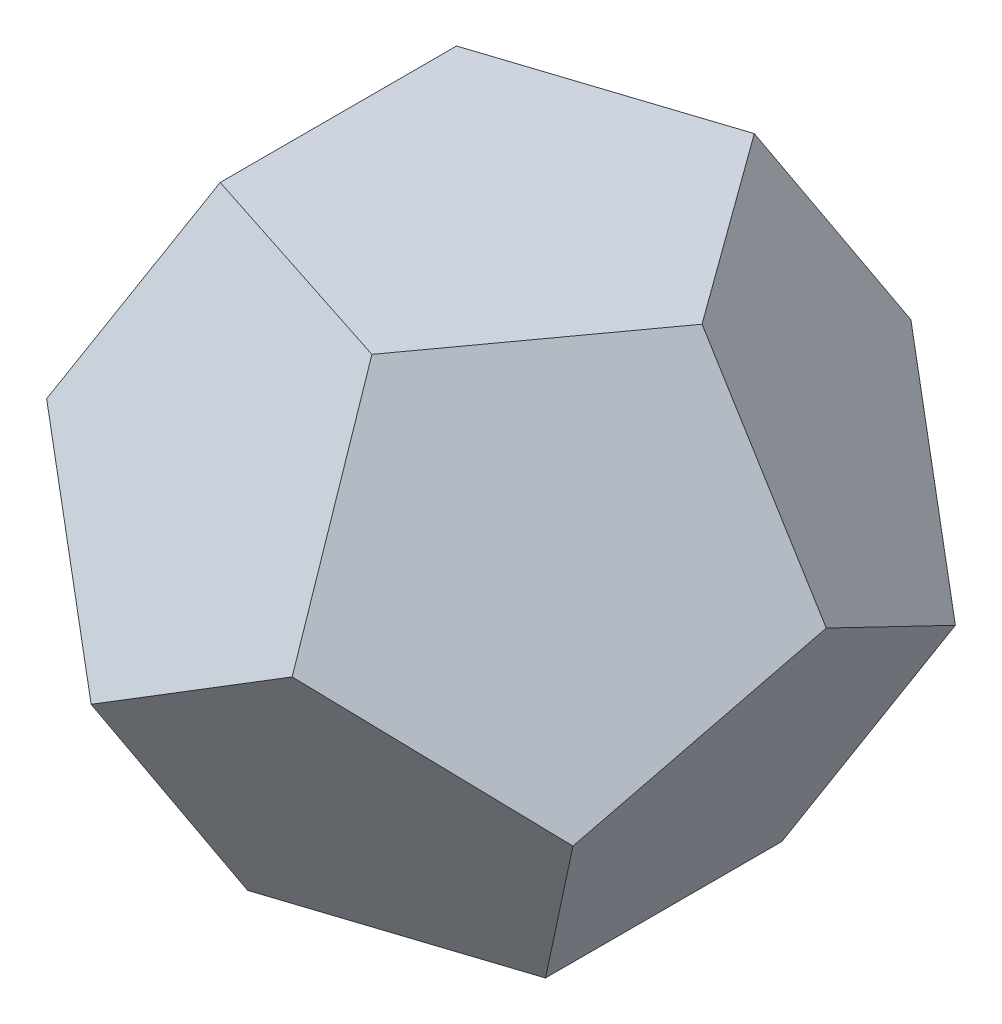
ISO-10303-21;
HEADER;
FILE_DESCRIPTION(('STEP AP214'),'2;1');
FILE_NAME('part.step','',(''),(''),'','','');
FILE_SCHEMA(('AUTOMOTIVE_DESIGN { 1 0 10303 214 1 1 1 1 }'));
ENDSEC;
DATA;
#1=APPLICATION_CONTEXT('core data for automotive mechanical design processes');
#2=APPLICATION_PROTOCOL_DEFINITION('international standard','automotive_design',2000,#1);
#3=PRODUCT_CONTEXT('',#1,'mechanical');
#4=PRODUCT('Part','Part','',(#3));
#5=PRODUCT_RELATED_PRODUCT_CATEGORY('part','',(#4));
#6=PRODUCT_DEFINITION_FORMATION('','',#4);
#7=PRODUCT_DEFINITION_CONTEXT('part definition',#1,'design');
#8=PRODUCT_DEFINITION('design','',#6,#7);
#9=PRODUCT_DEFINITION_SHAPE('','',#8);
#10=(LENGTH_UNIT() NAMED_UNIT(*) SI_UNIT(.MILLI.,.METRE.));
#11=(NAMED_UNIT(*) PLANE_ANGLE_UNIT() SI_UNIT($,.RADIAN.));
#12=(NAMED_UNIT(*) SI_UNIT($,.STERADIAN.) SOLID_ANGLE_UNIT());
#13=UNCERTAINTY_MEASURE_WITH_UNIT(LENGTH_MEASURE(1.E-05),#10,'distance_accuracy_value','');
#14=(GEOMETRIC_REPRESENTATION_CONTEXT(3) GLOBAL_UNCERTAINTY_ASSIGNED_CONTEXT((#13)) GLOBAL_UNIT_ASSIGNED_CONTEXT((#10,
#11,#12)) REPRESENTATION_CONTEXT('',''));
#15=CARTESIAN_POINT('',(0.,0.,0.));
#16=DIRECTION('',(0.,0.,1.));
#17=DIRECTION('',(1.,0.,0.));
#18=AXIS2_PLACEMENT_3D('',#15,#16,#17);
#19=CARTESIAN_POINT('',(-16.5993218992186,-70.3158559454907,-51.0874597374976));
#20=DIRECTION('',(0.187592474085081,0.794654472291766,0.577350269189626));
#21=DIRECTION('',(0.,-0.587785252292473,0.809016994374948));
#22=AXIS2_PLACEMENT_3D('',#19,#20,#21);
#23=PLANE('',#22);
#24=DIRECTION('',(-0.951056516295153,0.,0.309016994374949));
#25=VECTOR('',#24,1.);
#26=CARTESIAN_POINT('',(15.3884176858763,-80.5748010694083,-47.360679774998));
#27=LINE('',#26,#25);
#28=CARTESIAN_POINT('',(15.3884176858763,-80.5748010694083,-47.360679774998));
#29=VERTEX_POINT('',#28);
#30=CARTESIAN_POINT('',(-40.2874005347042,-80.5748010694083,-29.2705098312484));
#31=VERTEX_POINT('',#30);
#32=EDGE_CURVE('E53',#29,#31,#27,.T.);
#33=ORIENTED_EDGE('',*,*,#32,.F.);
#34=DIRECTION('',(0.262865556059569,0.525731112119133,-0.809016994374947));
#35=VECTOR('',#34,1.);
#36=CARTESIAN_POINT('',(-1.11022302462516E-13,-111.351636441161,0.));
#37=LINE('',#36,#35);
#38=CARTESIAN_POINT('',(-1.29236898960272E-13,-111.351636441161,0.));
#39=VERTEX_POINT('',#38);
#40=EDGE_CURVE('E106',#39,#29,#37,.T.);
#41=ORIENTED_EDGE('',*,*,#40,.F.);
#42=DIRECTION('',(-0.688190960235587,0.525731112119134,-0.499999999999999));
#43=VECTOR('',#42,1.);
#44=CARTESIAN_POINT('',(-40.2874005347042,-80.5748010694083,-29.2705098312484));
#45=LINE('',#44,#43);
#46=EDGE_CURVE('E101',#39,#31,#45,.T.);
#47=ORIENTED_EDGE('',*,*,#46,.T.);
#48=EDGE_LOOP('',(#33,#41,#47));
#49=FACE_BOUND('',#48,.T.);
#50=ADVANCED_FACE('F50',(#49),#23,.F.);
#51=CARTESIAN_POINT('',(-16.5993218992187,-10.2589451239176,-51.0874597374977));
#52=DIRECTION('',(-0.303530999103345,-0.187592474085081,-0.934172358962715));
#53=DIRECTION('',(-0.951056516295153,0.,0.309016994374949));
#54=AXIS2_PLACEMENT_3D('',#51,#52,#53);
#55=PLANE('',#54);
#56=DIRECTION('',(0.525731112119134,-0.850650808352039,0.));
#57=VECTOR('',#56,1.);
#58=CARTESIAN_POINT('',(-15.3884176858764,-30.7768353717526,-47.360679774998));
#59=LINE('',#58,#57);
#60=CARTESIAN_POINT('',(-15.3884176858764,-30.7768353717526,-47.360679774998));
#61=VERTEX_POINT('',#60);
#62=EDGE_CURVE('E111',#61,#29,#59,.T.);
#63=ORIENTED_EDGE('',*,*,#62,.T.);
#64=ORIENTED_EDGE('',*,*,#32,.T.);
#65=DIRECTION('',(0.425325404176019,0.85065080835204,-0.309016994374949));
#66=VECTOR('',#65,1.);
#67=CARTESIAN_POINT('',(-40.2874005347042,-80.5748010694083,-29.2705098312484));
#68=LINE('',#67,#66);
#69=EDGE_CURVE('E114',#31,#61,#68,.T.);
#70=ORIENTED_EDGE('',*,*,#69,.T.);
#71=EDGE_LOOP('',(#63,#64,#70));
#72=FACE_BOUND('',#71,.T.);
#73=ADVANCED_FACE('F113',(#72),#55,.T.);
#74=CARTESIAN_POINT('',(-53.7165340462723,-70.3158559454908,0.));
#75=DIRECTION('',(0.607061998206687,0.794654472291766,0.));
#76=DIRECTION('',(-0.794654472291766,0.607061998206686,0.));
#77=AXIS2_PLACEMENT_3D('',#74,#75,#76);
#78=PLANE('',#77);
#79=DIRECTION('',(0.,0.,1.));
#80=VECTOR('',#79,1.);
#81=CARTESIAN_POINT('',(-40.2874005347042,-80.5748010694083,-29.2705098312484));
#82=LINE('',#81,#80);
#83=CARTESIAN_POINT('',(-40.2874005347043,-80.5748010694083,29.2705098312485));
#84=VERTEX_POINT('',#83);
#85=EDGE_CURVE('E142',#31,#84,#82,.T.);
#86=ORIENTED_EDGE('',*,*,#85,.F.);
#87=ORIENTED_EDGE('',*,*,#46,.F.);
#88=DIRECTION('',(-0.688190960235586,0.525731112119133,0.500000000000001));
#89=VECTOR('',#88,1.);
#90=CARTESIAN_POINT('',(-40.2874005347043,-80.5748010694082,29.2705098312485));
#91=LINE('',#90,#89);
#92=EDGE_CURVE('E168',#39,#84,#91,.T.);
#93=ORIENTED_EDGE('',*,*,#92,.T.);
#94=EDGE_LOOP('',(#86,#87,#93));
#95=FACE_BOUND('',#94,.T.);
#96=ADVANCED_FACE('F447',(#95),#78,.F.);
#97=CARTESIAN_POINT('',(43.4575889223547,-70.3158559454908,-31.5737865166652));
#98=DIRECTION('',(0.491123473188423,-0.794654472291767,-0.356822089773089));
#99=DIRECTION('',(0.85065080835204,0.525731112119134,0.));
#100=AXIS2_PLACEMENT_3D('',#97,#98,#99);
#101=PLANE('',#100);
#102=DIRECTION('',(-0.85065080835204,-0.525731112119134,0.));
#103=VECTOR('',#102,1.);
#104=CARTESIAN_POINT('',(49.7979656976556,-80.5748010694082,0.));
#105=LINE('',#104,#103);
#106=CARTESIAN_POINT('',(49.7979656976556,-80.5748010694083,0.));
#107=VERTEX_POINT('',#106);
#108=EDGE_CURVE('E135',#107,#39,#105,.T.);
#109=ORIENTED_EDGE('',*,*,#108,.T.);
#110=ORIENTED_EDGE('',*,*,#40,.T.);
#111=DIRECTION('',(-0.587785252292473,0.,-0.809016994374948));
#112=VECTOR('',#111,1.);
#113=CARTESIAN_POINT('',(15.3884176858763,-80.5748010694083,-47.360679774998));
#114=LINE('',#113,#112);
#115=EDGE_CURVE('E129',#107,#29,#114,.T.);
#116=ORIENTED_EDGE('',*,*,#115,.F.);
#117=EDGE_LOOP('',(#109,#110,#116));
#118=FACE_BOUND('',#117,.T.);
#119=ADVANCED_FACE('F133',(#118),#101,.T.);
#120=CARTESIAN_POINT('',(10.2589451239175,6.34037677530105,-31.5737865166654));
#121=DIRECTION('',(-0.303530999103342,-0.18759247408508,0.934172358962716));
#122=DIRECTION('',(0.951056516295154,0.,0.309016994374947));
#123=AXIS2_PLACEMENT_3D('',#120,#121,#122);
#124=PLANE('',#123);
#125=DIRECTION('',(-0.951056516295154,0.,-0.309016994374947));
#126=VECTOR('',#125,1.);
#127=CARTESIAN_POINT('',(-15.3884176858764,-30.7768353717526,-47.360679774998));
#128=LINE('',#127,#126);
#129=CARTESIAN_POINT('',(40.2874005347042,-30.7768353717526,-29.2705098312485));
#130=VERTEX_POINT('',#129);
#131=EDGE_CURVE('E123',#130,#61,#128,.T.);
#132=ORIENTED_EDGE('',*,*,#131,.F.);
#133=DIRECTION('',(0.42532540417602,0.85065080835204,0.309016994374947));
#134=VECTOR('',#133,1.);
#135=CARTESIAN_POINT('',(15.3884176858763,-80.5748010694083,-47.360679774998));
#136=LINE('',#135,#134);
#137=EDGE_CURVE('E118',#29,#130,#136,.T.);
#138=ORIENTED_EDGE('',*,*,#137,.F.);
#139=ORIENTED_EDGE('',*,*,#62,.F.);
#140=EDGE_LOOP('',(#132,#138,#139));
#141=FACE_BOUND('',#140,.T.);
#142=ADVANCED_FACE('F121',(#141),#124,.F.);
#143=CARTESIAN_POINT('',(43.4575889223547,-10.2589451239176,-31.5737865166653));
#144=DIRECTION('',(-0.794654472291766,0.187592474085081,0.577350269189625));
#145=DIRECTION('',(0.587785252292473,0.,0.809016994374948));
#146=AXIS2_PLACEMENT_3D('',#143,#144,#145);
#147=PLANE('',#146);
#148=ORIENTED_EDGE('',*,*,#137,.T.);
#149=DIRECTION('',(0.162459848116452,-0.85065080835204,0.5));
#150=VECTOR('',#149,1.);
#151=CARTESIAN_POINT('',(49.7979656976557,-80.5748010694083,0.));
#152=LINE('',#151,#150);
#153=EDGE_CURVE('E140',#130,#107,#152,.T.);
#154=ORIENTED_EDGE('',*,*,#153,.T.);
#155=ORIENTED_EDGE('',*,*,#115,.T.);
#156=EDGE_LOOP('',(#148,#154,#155));
#157=FACE_BOUND('',#156,.T.);
#158=ADVANCED_FACE('F139',(#157),#147,.F.);
#159=CARTESIAN_POINT('',(-53.7165340462722,-10.2589451239175,-1.15180933535482E-13));
#160=DIRECTION('',(-0.982246946376846,-0.187592474085079,0.));
#161=DIRECTION('',(0.187592474085079,-0.982246946376846,0.));
#162=AXIS2_PLACEMENT_3D('',#159,#160,#161);
#163=PLANE('',#162);
#164=DIRECTION('',(0.162459848116453,-0.85065080835204,-0.499999999999999));
#165=VECTOR('',#164,1.);
#166=CARTESIAN_POINT('',(-49.7979656976558,-30.7768353717526,0.));
#167=LINE('',#166,#165);
#168=CARTESIAN_POINT('',(-49.7979656976558,-30.7768353717526,0.));
#169=VERTEX_POINT('',#168);
#170=EDGE_CURVE('E149',#169,#31,#167,.T.);
#171=ORIENTED_EDGE('',*,*,#170,.T.);
#172=ORIENTED_EDGE('',*,*,#85,.T.);
#173=DIRECTION('',(0.162459848116451,-0.85065080835204,0.5));
#174=VECTOR('',#173,1.);
#175=CARTESIAN_POINT('',(-49.7979656976558,-30.7768353717526,0.));
#176=LINE('',#175,#174);
#177=EDGE_CURVE('E198',#169,#84,#176,.T.);
#178=ORIENTED_EDGE('',*,*,#177,.F.);
#179=EDGE_LOOP('',(#171,#172,#178));
#180=FACE_BOUND('',#179,.T.);
#181=ADVANCED_FACE('F424',(#180),#163,.T.);
#182=CARTESIAN_POINT('',(-26.8582670231362,6.34037677530102,-19.5136732208324));
#183=DIRECTION('',(0.794654472291767,-0.187592474085079,0.577350269189626));
#184=DIRECTION('',(0.587785252292473,0.,-0.809016994374948));
#185=AXIS2_PLACEMENT_3D('',#182,#183,#184);
#186=PLANE('',#185);
#187=DIRECTION('',(-0.587785252292473,0.,0.809016994374948));
#188=VECTOR('',#187,1.);
#189=CARTESIAN_POINT('',(-49.7979656976558,-30.7768353717526,0.));
#190=LINE('',#189,#188);
#191=EDGE_CURVE('E194',#61,#169,#190,.T.);
#192=ORIENTED_EDGE('',*,*,#191,.F.);
#193=ORIENTED_EDGE('',*,*,#69,.F.);
#194=ORIENTED_EDGE('',*,*,#170,.F.);
#195=EDGE_LOOP('',(#192,#193,#194));
#196=FACE_BOUND('',#195,.T.);
#197=ADVANCED_FACE('F422',(#196),#186,.F.);
#198=CARTESIAN_POINT('',(-16.5993218992185,-70.3158559454908,51.0874597374976));
#199=DIRECTION('',(0.187592474085079,0.794654472291766,-0.577350269189626));
#200=DIRECTION('',(0.,0.587785252292473,0.809016994374947));
#201=AXIS2_PLACEMENT_3D('',#198,#199,#200);
#202=PLANE('',#201);
#203=DIRECTION('',(-0.951056516295154,0.,-0.309016994374947));
#204=VECTOR('',#203,1.);
#205=CARTESIAN_POINT('',(-40.2874005347043,-80.5748010694083,29.2705098312485));
#206=LINE('',#205,#204);
#207=CARTESIAN_POINT('',(15.3884176858762,-80.5748010694083,47.360679774998));
#208=VERTEX_POINT('',#207);
#209=EDGE_CURVE('E270',#208,#84,#206,.T.);
#210=ORIENTED_EDGE('',*,*,#209,.T.);
#211=ORIENTED_EDGE('',*,*,#92,.F.);
#212=DIRECTION('',(0.262865556059567,0.525731112119133,0.809016994374947));
#213=VECTOR('',#212,1.);
#214=CARTESIAN_POINT('',(15.3884176858762,-80.5748010694083,47.360679774998));
#215=LINE('',#214,#213);
#216=EDGE_CURVE('E242',#39,#208,#215,.T.);
#217=ORIENTED_EDGE('',*,*,#216,.T.);
#218=EDGE_LOOP('',(#210,#211,#217));
#219=FACE_BOUND('',#218,.T.);
#220=ADVANCED_FACE('F428',(#219),#202,.F.);
#221=CARTESIAN_POINT('',(43.4575889223547,-70.3158559454907,31.5737865166653));
#222=DIRECTION('',(-0.491123473188423,0.794654472291766,-0.356822089773089));
#223=DIRECTION('',(-0.85065080835204,-0.525731112119134,0.));
#224=AXIS2_PLACEMENT_3D('',#221,#222,#223);
#225=PLANE('',#224);
#226=ORIENTED_EDGE('',*,*,#216,.F.);
#227=ORIENTED_EDGE('',*,*,#108,.F.);
#228=DIRECTION('',(-0.587785252292473,0.,0.809016994374948));
#229=VECTOR('',#228,1.);
#230=CARTESIAN_POINT('',(15.3884176858762,-80.5748010694083,47.360679774998));
#231=LINE('',#230,#229);
#232=EDGE_CURVE('E254',#107,#208,#231,.T.);
#233=ORIENTED_EDGE('',*,*,#232,.T.);
#234=EDGE_LOOP('',(#226,#227,#233));
#235=FACE_BOUND('',#234,.T.);
#236=ADVANCED_FACE('F397',(#235),#225,.F.);
#237=CARTESIAN_POINT('',(0.,0.,0.));
#238=DIRECTION('',(-0.187592474085079,-0.794654472291767,0.577350269189625));
#239=DIRECTION('',(0.,-0.587785252292473,-0.809016994374948));
#240=AXIS2_PLACEMENT_3D('',#237,#238,#239);
#241=PLANE('',#240);
#242=ORIENTED_EDGE('',*,*,#131,.T.);
#243=DIRECTION('',(-0.262865556059568,-0.525731112119133,-0.809016994374947));
#244=VECTOR('',#243,1.);
#245=CARTESIAN_POINT('',(-15.3884176858764,-30.7768353717526,-47.360679774998));
#246=LINE('',#245,#244);
#247=CARTESIAN_POINT('',(0.,0.,0.));
#248=VERTEX_POINT('',#247);
#249=EDGE_CURVE('E282',#248,#61,#246,.T.);
#250=ORIENTED_EDGE('',*,*,#249,.F.);
#251=DIRECTION('',(-0.688190960235587,0.525731112119133,0.5));
#252=VECTOR('',#251,1.);
#253=CARTESIAN_POINT('',(40.2874005347042,-30.7768353717526,-29.2705098312485));
#254=LINE('',#253,#252);
#255=EDGE_CURVE('E335',#130,#248,#254,.T.);
#256=ORIENTED_EDGE('',*,*,#255,.F.);
#257=EDGE_LOOP('',(#242,#250,#256));
#258=FACE_BOUND('',#257,.T.);
#259=ADVANCED_FACE('F386',(#258),#241,.F.);
#260=CARTESIAN_POINT('',(33.1986437984372,6.340376775301,0.));
#261=DIRECTION('',(-0.982246946376846,-0.187592474085079,0.));
#262=DIRECTION('',(0.187592474085079,-0.982246946376846,0.));
#263=AXIS2_PLACEMENT_3D('',#260,#261,#262);
#264=PLANE('',#263);
#265=DIRECTION('',(0.162459848116452,-0.85065080835204,-0.500000000000001));
#266=VECTOR('',#265,1.);
#267=CARTESIAN_POINT('',(49.7979656976556,-80.5748010694082,0.));
#268=LINE('',#267,#266);
#269=CARTESIAN_POINT('',(40.2874005347041,-30.7768353717526,29.2705098312485));
#270=VERTEX_POINT('',#269);
#271=EDGE_CURVE('E260',#270,#107,#268,.T.);
#272=ORIENTED_EDGE('',*,*,#271,.T.);
#273=ORIENTED_EDGE('',*,*,#153,.F.);
#274=DIRECTION('',(0.,0.,-1.));
#275=VECTOR('',#274,1.);
#276=CARTESIAN_POINT('',(40.2874005347041,-30.7768353717526,29.2705098312485));
#277=LINE('',#276,#275);
#278=EDGE_CURVE('E69',#270,#130,#277,.T.);
#279=ORIENTED_EDGE('',*,*,#278,.F.);
#280=EDGE_LOOP('',(#272,#273,#279));
#281=FACE_BOUND('',#280,.T.);
#282=ADVANCED_FACE('F387',(#281),#264,.F.);
#283=CARTESIAN_POINT('',(-26.8582670231361,6.34037677530109,19.5136732208323));
#284=DIRECTION('',(-0.794654472291766,0.187592474085082,0.577350269189626));
#285=DIRECTION('',(0.587785252292473,0.,0.809016994374947));
#286=AXIS2_PLACEMENT_3D('',#283,#284,#285);
#287=PLANE('',#286);
#288=ORIENTED_EDGE('',*,*,#177,.T.);
#289=DIRECTION('',(0.425325404176022,0.850650808352039,0.309016994374947));
#290=VECTOR('',#289,1.);
#291=CARTESIAN_POINT('',(-40.2874005347043,-80.5748010694083,29.2705098312485));
#292=LINE('',#291,#290);
#293=CARTESIAN_POINT('',(-15.3884176858764,-30.7768353717526,47.360679774998));
#294=VERTEX_POINT('',#293);
#295=EDGE_CURVE('E261',#84,#294,#292,.T.);
#296=ORIENTED_EDGE('',*,*,#295,.T.);
#297=DIRECTION('',(0.587785252292473,0.,0.809016994374947));
#298=VECTOR('',#297,1.);
#299=CARTESIAN_POINT('',(-15.3884176858763,-30.7768353717526,47.360679774998));
#300=LINE('',#299,#298);
#301=EDGE_CURVE('E307',#169,#294,#300,.T.);
#302=ORIENTED_EDGE('',*,*,#301,.F.);
#303=EDGE_LOOP('',(#288,#296,#302));
#304=FACE_BOUND('',#303,.T.);
#305=ADVANCED_FACE('F389',(#304),#287,.T.);
#306=CARTESIAN_POINT('',(0.,0.,0.));
#307=DIRECTION('',(0.491123473188423,-0.794654472291766,0.356822089773089));
#308=DIRECTION('',(0.85065080835204,0.525731112119133,0.));
#309=AXIS2_PLACEMENT_3D('',#306,#307,#308);
#310=PLANE('',#309);
#311=ORIENTED_EDGE('',*,*,#191,.T.);
#312=DIRECTION('',(-0.85065080835204,-0.525731112119133,0.));
#313=VECTOR('',#312,1.);
#314=CARTESIAN_POINT('',(-49.7979656976558,-30.7768353717526,0.));
#315=LINE('',#314,#313);
#316=EDGE_CURVE('E302',#248,#169,#315,.T.);
#317=ORIENTED_EDGE('',*,*,#316,.F.);
#318=ORIENTED_EDGE('',*,*,#249,.T.);
#319=EDGE_LOOP('',(#311,#317,#318));
#320=FACE_BOUND('',#319,.T.);
#321=ADVANCED_FACE('F395',(#320),#310,.F.);
#322=CARTESIAN_POINT('',(-16.5993218992186,-10.2589451239175,51.0874597374977));
#323=DIRECTION('',(-0.303530999103342,-0.18759247408508,0.934172358962716));
#324=DIRECTION('',(0.951056516295154,0.,0.309016994374947));
#325=AXIS2_PLACEMENT_3D('',#322,#323,#324);
#326=PLANE('',#325);
#327=ORIENTED_EDGE('',*,*,#209,.F.);
#328=DIRECTION('',(-0.525731112119133,0.85065080835204,0.));
#329=VECTOR('',#328,1.);
#330=CARTESIAN_POINT('',(15.3884176858762,-80.5748010694083,47.360679774998));
#331=LINE('',#330,#329);
#332=EDGE_CURVE('E294',#208,#294,#331,.T.);
#333=ORIENTED_EDGE('',*,*,#332,.T.);
#334=ORIENTED_EDGE('',*,*,#295,.F.);
#335=EDGE_LOOP('',(#327,#333,#334));
#336=FACE_BOUND('',#335,.T.);
#337=ADVANCED_FACE('F368',(#336),#326,.T.);
#338=CARTESIAN_POINT('',(43.4575889223547,-10.2589451239176,31.5737865166653));
#339=DIRECTION('',(0.794654472291766,-0.187592474085081,0.577350269189625));
#340=DIRECTION('',(0.587785252292473,0.,-0.809016994374948));
#341=AXIS2_PLACEMENT_3D('',#338,#339,#340);
#342=PLANE('',#341);
#343=ORIENTED_EDGE('',*,*,#232,.F.);
#344=ORIENTED_EDGE('',*,*,#271,.F.);
#345=DIRECTION('',(-0.425325404176021,-0.850650808352039,0.309016994374947));
#346=VECTOR('',#345,1.);
#347=CARTESIAN_POINT('',(15.3884176858762,-80.5748010694083,47.360679774998));
#348=LINE('',#347,#346);
#349=EDGE_CURVE('E349',#270,#208,#348,.T.);
#350=ORIENTED_EDGE('',*,*,#349,.T.);
#351=EDGE_LOOP('',(#343,#344,#350));
#352=FACE_BOUND('',#351,.T.);
#353=ADVANCED_FACE('F410',(#352),#342,.T.);
#354=CARTESIAN_POINT('',(0.,0.,0.));
#355=DIRECTION('',(0.607061998206686,0.794654472291766,0.));
#356=DIRECTION('',(-0.794654472291766,0.607061998206686,0.));
#357=AXIS2_PLACEMENT_3D('',#354,#355,#356);
#358=PLANE('',#357);
#359=ORIENTED_EDGE('',*,*,#255,.T.);
#360=DIRECTION('',(-0.688190960235587,0.525731112119134,-0.5));
#361=VECTOR('',#360,1.);
#362=CARTESIAN_POINT('',(0.,0.,0.));
#363=LINE('',#362,#361);
#364=EDGE_CURVE('E327',#270,#248,#363,.T.);
#365=ORIENTED_EDGE('',*,*,#364,.F.);
#366=ORIENTED_EDGE('',*,*,#278,.T.);
#367=EDGE_LOOP('',(#359,#365,#366));
#368=FACE_BOUND('',#367,.T.);
#369=ADVANCED_FACE('F384',(#368),#358,.T.);
#370=CARTESIAN_POINT('',(0.,0.,0.));
#371=DIRECTION('',(0.491123473188423,-0.794654472291767,-0.35682208977309));
#372=DIRECTION('',(0.85065080835204,0.525731112119133,0.));
#373=AXIS2_PLACEMENT_3D('',#370,#371,#372);
#374=PLANE('',#373);
#375=ORIENTED_EDGE('',*,*,#301,.T.);
#376=DIRECTION('',(-0.262865556059568,-0.525731112119133,0.809016994374948));
#377=VECTOR('',#376,1.);
#378=CARTESIAN_POINT('',(-15.3884176858764,-30.7768353717526,47.360679774998));
#379=LINE('',#378,#377);
#380=EDGE_CURVE('E60',#248,#294,#379,.T.);
#381=ORIENTED_EDGE('',*,*,#380,.F.);
#382=ORIENTED_EDGE('',*,*,#316,.T.);
#383=EDGE_LOOP('',(#375,#381,#382));
#384=FACE_BOUND('',#383,.T.);
#385=ADVANCED_FACE('F375',(#384),#374,.F.);
#386=CARTESIAN_POINT('',(10.2589451239175,6.34037677530102,31.5737865166653));
#387=DIRECTION('',(0.303530999103344,0.187592474085079,0.934172358962716));
#388=DIRECTION('',(0.951056516295153,0.,-0.309016994374948));
#389=AXIS2_PLACEMENT_3D('',#386,#387,#388);
#390=PLANE('',#389);
#391=ORIENTED_EDGE('',*,*,#332,.F.);
#392=ORIENTED_EDGE('',*,*,#349,.F.);
#393=DIRECTION('',(0.951056516295154,0.,-0.309016994374948));
#394=VECTOR('',#393,1.);
#395=CARTESIAN_POINT('',(40.2874005347041,-30.7768353717526,29.2705098312485));
#396=LINE('',#395,#394);
#397=EDGE_CURVE('E12',#294,#270,#396,.T.);
#398=ORIENTED_EDGE('',*,*,#397,.F.);
#399=EDGE_LOOP('',(#391,#392,#398));
#400=FACE_BOUND('',#399,.T.);
#401=ADVANCED_FACE('F378',(#400),#390,.T.);
#402=CARTESIAN_POINT('',(0.,0.,0.));
#403=DIRECTION('',(-0.18759247408508,-0.794654472291766,-0.577350269189626));
#404=DIRECTION('',(0.,0.587785252292473,-0.809016994374947));
#405=AXIS2_PLACEMENT_3D('',#402,#403,#404);
#406=PLANE('',#405);
#407=ORIENTED_EDGE('',*,*,#364,.T.);
#408=ORIENTED_EDGE('',*,*,#380,.T.);
#409=ORIENTED_EDGE('',*,*,#397,.T.);
#410=EDGE_LOOP('',(#407,#408,#409));
#411=FACE_BOUND('',#410,.T.);
#412=ADVANCED_FACE('F380',(#411),#406,.F.);
#413=CLOSED_SHELL('',(#50,#73,#96,#119,#142,#158,#181,#197,#220,#236,#259,#282,#305,#321,#337,
#353,#369,#385,#401,#412));
#414=MANIFOLD_SOLID_BREP('B2',#413);
#415=CARTESIAN_POINT('',(1.3912374529495E-13,-111.351636441161,1.28134317205566E-13));
#416=DIRECTION('',(0.,1.,0.));
#417=DIRECTION('',(-1.,0.,0.));
#418=AXIS2_PLACEMENT_3D('',#415,#416,#417);
#419=PLANE('',#418);
#420=DIRECTION('',(-0.587785252292473,0.,-0.809016994374948));
#421=VECTOR('',#420,1.);
#422=CARTESIAN_POINT('',(-42.5325404176024,-111.351636441161,0.));
#423=LINE('',#422,#421);
#424=CARTESIAN_POINT('',(-13.1432778029785,-111.351636441161,40.4508497187475));
#425=VERTEX_POINT('',#424);
#426=CARTESIAN_POINT('',(-42.5325404176022,-111.351636441161,0.));
#427=VERTEX_POINT('',#426);
#428=EDGE_CURVE('E677',#425,#427,#423,.T.);
#429=ORIENTED_EDGE('',*,*,#428,.T.);
#430=DIRECTION('',(0.587785252292473,0.,-0.809016994374948));
#431=VECTOR('',#430,1.);
#432=CARTESIAN_POINT('',(-13.1432778029784,-111.351636441161,-40.4508497187475));
#433=LINE('',#432,#431);
#434=CARTESIAN_POINT('',(-13.1432778029784,-111.351636441161,-40.4508497187474));
#435=VERTEX_POINT('',#434);
#436=EDGE_CURVE('E643',#427,#435,#433,.T.);
#437=ORIENTED_EDGE('',*,*,#436,.T.);
#438=DIRECTION('',(-0.951056516295155,0.,-0.309016994374943));
#439=VECTOR('',#438,1.);
#440=CARTESIAN_POINT('',(-13.1432778029785,-111.351636441161,-40.4508497187473));
#441=LINE('',#440,#439);
#442=CARTESIAN_POINT('',(34.4095480117793,-111.351636441161,-25.0000000000001));
#443=VERTEX_POINT('',#442);
#444=EDGE_CURVE('E645',#443,#435,#441,.T.);
#445=ORIENTED_EDGE('',*,*,#444,.F.);
#446=DIRECTION('',(0.,0.,-1.));
#447=VECTOR('',#446,1.);
#448=CARTESIAN_POINT('',(34.4095480117793,-111.351636441161,25.));
#449=LINE('',#448,#447);
#450=CARTESIAN_POINT('',(34.4095480117793,-111.351636441161,25.));
#451=VERTEX_POINT('',#450);
#452=EDGE_CURVE('E576',#451,#443,#449,.T.);
#453=ORIENTED_EDGE('',*,*,#452,.F.);
#454=DIRECTION('',(-0.951056516295153,0.,0.309016994374948));
#455=VECTOR('',#454,1.);
#456=CARTESIAN_POINT('',(-13.1432778029785,-111.351636441161,40.4508497187474));
#457=LINE('',#456,#455);
#458=EDGE_CURVE('E686',#451,#425,#457,.T.);
#459=ORIENTED_EDGE('',*,*,#458,.T.);
#460=EDGE_LOOP('',(#429,#437,#445,#453,#459));
#461=FACE_BOUND('',#460,.T.);
#462=ADVANCED_FACE('F573',(#461),#419,.F.);
#463=CARTESIAN_POINT('',(72.0682929858879,-36.0341464929442,0.));
#464=DIRECTION('',(0.894427190999915,-0.44721359549996,0.));
#465=DIRECTION('',(0.44721359549996,0.894427190999915,0.));
#466=AXIS2_PLACEMENT_3D('',#463,#464,#465);
#467=PLANE('',#466);
#468=DIRECTION('',(-0.262865556059568,-0.525731112119132,0.809016994374948));
#469=VECTOR('',#468,1.);
#470=CARTESIAN_POINT('',(68.8190960235588,-42.5325404176021,0.));
#471=LINE('',#470,#469);
#472=CARTESIAN_POINT('',(68.8190960235589,-42.5325404176021,0.));
#473=VERTEX_POINT('',#472);
#474=CARTESIAN_POINT('',(55.6758182205804,-68.8190960235588,40.4508497187474));
#475=VERTEX_POINT('',#474);
#476=EDGE_CURVE('E685',#473,#475,#471,.T.);
#477=ORIENTED_EDGE('',*,*,#476,.T.);
#478=DIRECTION('',(-0.425325404176022,-0.850650808352039,-0.309016994374948));
#479=VECTOR('',#478,1.);
#480=CARTESIAN_POINT('',(55.6758182205804,-68.8190960235587,40.4508497187474));
#481=LINE('',#480,#479);
#482=EDGE_CURVE('E659',#475,#451,#481,.T.);
#483=ORIENTED_EDGE('',*,*,#482,.T.);
#484=ORIENTED_EDGE('',*,*,#452,.T.);
#485=DIRECTION('',(-0.425325404176021,-0.850650808352038,0.30901699437495));
#486=VECTOR('',#485,1.);
#487=CARTESIAN_POINT('',(34.4095480117793,-111.351636441161,-25.0000000000001));
#488=LINE('',#487,#486);
#489=CARTESIAN_POINT('',(55.6758182205804,-68.8190960235588,-40.4508497187477));
#490=VERTEX_POINT('',#489);
#491=EDGE_CURVE('E652',#490,#443,#488,.T.);
#492=ORIENTED_EDGE('',*,*,#491,.F.);
#493=DIRECTION('',(0.262865556059568,0.525731112119131,0.809016994374949));
#494=VECTOR('',#493,1.);
#495=CARTESIAN_POINT('',(68.8190960235589,-42.5325404176021,0.));
#496=LINE('',#495,#494);
#497=EDGE_CURVE('E697',#490,#473,#496,.T.);
#498=ORIENTED_EDGE('',*,*,#497,.T.);
#499=EDGE_LOOP('',(#477,#483,#484,#492,#498));
#500=FACE_BOUND('',#499,.T.);
#501=ADVANCED_FACE('F655',(#500),#467,.T.);
#502=CARTESIAN_POINT('',(22.2703272882319,-36.0341464929441,-68.5410196624971));
#503=DIRECTION('',(-0.276393202250018,0.44721359549996,0.85065080835204));
#504=DIRECTION('',(0.,-0.885131422637847,0.465341127194988));
#505=AXIS2_PLACEMENT_3D('',#502,#503,#504);
#506=PLANE('',#505);
#507=ORIENTED_EDGE('',*,*,#444,.T.);
#508=DIRECTION('',(-0.162459848116454,0.850650808352039,-0.500000000000001));
#509=VECTOR('',#508,1.);
#510=CARTESIAN_POINT('',(-21.2662702088011,-68.819096023559,-65.4508497187475));
#511=LINE('',#510,#509);
#512=CARTESIAN_POINT('',(-21.2662702088011,-68.8190960235589,-65.4508497187475));
#513=VERTEX_POINT('',#512);
#514=EDGE_CURVE('E671',#435,#513,#511,.T.);
#515=ORIENTED_EDGE('',*,*,#514,.T.);
#516=DIRECTION('',(0.850650808352039,0.525731112119135,0.));
#517=VECTOR('',#516,1.);
#518=CARTESIAN_POINT('',(21.2662702088011,-42.5325404176021,-65.4508497187476));
#519=LINE('',#518,#517);
#520=CARTESIAN_POINT('',(21.2662702088011,-42.5325404176021,-65.4508497187476));
#521=VERTEX_POINT('',#520);
#522=EDGE_CURVE('E710',#513,#521,#519,.T.);
#523=ORIENTED_EDGE('',*,*,#522,.T.);
#524=DIRECTION('',(0.688190960235587,-0.525731112119134,0.499999999999998));
#525=VECTOR('',#524,1.);
#526=CARTESIAN_POINT('',(55.6758182205805,-68.8190960235588,-40.4508497187477));
#527=LINE('',#526,#525);
#528=EDGE_CURVE('E664',#521,#490,#527,.T.);
#529=ORIENTED_EDGE('',*,*,#528,.T.);
#530=ORIENTED_EDGE('',*,*,#491,.T.);
#531=EDGE_LOOP('',(#507,#515,#523,#529,#530));
#532=FACE_BOUND('',#531,.T.);
#533=ADVANCED_FACE('F662',(#532),#506,.F.);
#534=CARTESIAN_POINT('',(-58.3044737811762,-36.034146492944,-42.3606797749978));
#535=DIRECTION('',(0.72360679774998,0.447213595499958,0.525731112119132));
#536=DIRECTION('',(0.587785252292471,0.,-0.809016994374949));
#537=AXIS2_PLACEMENT_3D('',#534,#535,#536);
#538=PLANE('',#537);
#539=DIRECTION('',(0.688190960235585,-0.525731112119135,-0.500000000000001));
#540=VECTOR('',#539,1.);
#541=CARTESIAN_POINT('',(-21.2662702088011,-68.8190960235589,-65.4508497187477));
#542=LINE('',#541,#540);
#543=CARTESIAN_POINT('',(-55.6758182205805,-42.5325404176021,-40.4508497187475));
#544=VERTEX_POINT('',#543);
#545=EDGE_CURVE('E700',#544,#513,#542,.T.);
#546=ORIENTED_EDGE('',*,*,#545,.T.);
#547=ORIENTED_EDGE('',*,*,#514,.F.);
#548=ORIENTED_EDGE('',*,*,#436,.F.);
#549=DIRECTION('',(-0.525731112119131,0.850650808352042,0.));
#550=VECTOR('',#549,1.);
#551=CARTESIAN_POINT('',(-68.8190960235589,-68.8190960235588,0.));
#552=LINE('',#551,#550);
#553=CARTESIAN_POINT('',(-68.8190960235589,-68.8190960235588,0.));
#554=VERTEX_POINT('',#553);
#555=EDGE_CURVE('E675',#427,#554,#552,.T.);
#556=ORIENTED_EDGE('',*,*,#555,.T.);
#557=DIRECTION('',(0.262865556059567,0.525731112119133,-0.809016994374948));
#558=VECTOR('',#557,1.);
#559=CARTESIAN_POINT('',(-55.6758182205805,-42.5325404176021,-40.4508497187474));
#560=LINE('',#559,#558);
#561=EDGE_CURVE('E716',#554,#544,#560,.T.);
#562=ORIENTED_EDGE('',*,*,#561,.T.);
#563=EDGE_LOOP('',(#546,#547,#548,#556,#562));
#564=FACE_BOUND('',#563,.T.);
#565=ADVANCED_FACE('F791',(#564),#538,.F.);
#566=CARTESIAN_POINT('',(-58.3044737811762,-36.0341464929438,42.3606797749981));
#567=DIRECTION('',(-0.72360679774998,-0.447213595499956,0.525731112119134));
#568=DIRECTION('',(0.587785252292473,0.,0.809016994374948));
#569=AXIS2_PLACEMENT_3D('',#566,#567,#568);
#570=PLANE('',#569);
#571=ORIENTED_EDGE('',*,*,#555,.F.);
#572=ORIENTED_EDGE('',*,*,#428,.F.);
#573=DIRECTION('',(-0.162459848116453,0.850650808352039,0.500000000000002));
#574=VECTOR('',#573,1.);
#575=CARTESIAN_POINT('',(-21.2662702088012,-68.8190960235588,65.4508497187476));
#576=LINE('',#575,#574);
#577=CARTESIAN_POINT('',(-21.2662702088012,-68.8190960235588,65.4508497187476));
#578=VERTEX_POINT('',#577);
#579=EDGE_CURVE('E682',#425,#578,#576,.T.);
#580=ORIENTED_EDGE('',*,*,#579,.T.);
#581=DIRECTION('',(-0.688190960235585,0.525731112119134,-0.500000000000001));
#582=VECTOR('',#581,1.);
#583=CARTESIAN_POINT('',(-55.6758182205805,-42.532540417602,40.4508497187475));
#584=LINE('',#583,#582);
#585=CARTESIAN_POINT('',(-55.6758182205805,-42.532540417602,40.4508497187475));
#586=VERTEX_POINT('',#585);
#587=EDGE_CURVE('E720',#578,#586,#584,.T.);
#588=ORIENTED_EDGE('',*,*,#587,.T.);
#589=DIRECTION('',(-0.262865556059567,-0.525731112119134,-0.809016994374947));
#590=VECTOR('',#589,1.);
#591=CARTESIAN_POINT('',(-68.8190960235589,-68.8190960235588,0.));
#592=LINE('',#591,#590);
#593=EDGE_CURVE('E721',#586,#554,#592,.T.);
#594=ORIENTED_EDGE('',*,*,#593,.T.);
#595=EDGE_LOOP('',(#571,#572,#580,#588,#594));
#596=FACE_BOUND('',#595,.T.);
#597=ADVANCED_FACE('F789',(#596),#570,.T.);
#598=CARTESIAN_POINT('',(22.2703272882322,-36.0341464929441,68.541019662497));
#599=DIRECTION('',(0.276393202250022,-0.44721359549996,0.850650808352039));
#600=DIRECTION('',(0.,-0.885131422637846,-0.465341127194988));
#601=AXIS2_PLACEMENT_3D('',#598,#599,#600);
#602=PLANE('',#601);
#603=DIRECTION('',(-0.85065080835204,-0.525731112119133,0.));
#604=VECTOR('',#603,1.);
#605=CARTESIAN_POINT('',(-21.2662702088012,-68.8190960235588,65.4508497187476));
#606=LINE('',#605,#604);
#607=CARTESIAN_POINT('',(21.266270208801,-42.5325404176021,65.4508497187476));
#608=VERTEX_POINT('',#607);
#609=EDGE_CURVE('E728',#608,#578,#606,.T.);
#610=ORIENTED_EDGE('',*,*,#609,.T.);
#611=ORIENTED_EDGE('',*,*,#579,.F.);
#612=ORIENTED_EDGE('',*,*,#458,.F.);
#613=ORIENTED_EDGE('',*,*,#482,.F.);
#614=DIRECTION('',(-0.688190960235587,0.525731112119132,0.500000000000002));
#615=VECTOR('',#614,1.);
#616=CARTESIAN_POINT('',(55.6758182205804,-68.8190960235587,40.4508497187474));
#617=LINE('',#616,#615);
#618=EDGE_CURVE('E691',#475,#608,#617,.T.);
#619=ORIENTED_EDGE('',*,*,#618,.T.);
#620=EDGE_LOOP('',(#610,#611,#612,#613,#619));
#621=FACE_BOUND('',#620,.T.);
#622=ADVANCED_FACE('F784',(#621),#602,.T.);
#623=CARTESIAN_POINT('',(22.2703272882322,13.7638192047118,16.180339887499));
#624=DIRECTION('',(-0.723606797749979,-0.447213595499958,-0.525731112119134));
#625=DIRECTION('',(-0.587785252292473,0.,0.809016994374947));
#626=AXIS2_PLACEMENT_3D('',#623,#624,#625);
#627=PLANE('',#626);
#628=DIRECTION('',(0.587785252292473,0.,-0.809016994374947));
#629=VECTOR('',#628,1.);
#630=CARTESIAN_POINT('',(13.1432778029784,0.,40.4508497187475));
#631=LINE('',#630,#629);
#632=CARTESIAN_POINT('',(13.1432778029784,0.,40.4508497187475));
#633=VERTEX_POINT('',#632);
#634=CARTESIAN_POINT('',(42.5325404176021,0.,0.));
#635=VERTEX_POINT('',#634);
#636=EDGE_CURVE('E592',#633,#635,#631,.T.);
#637=ORIENTED_EDGE('',*,*,#636,.F.);
#638=DIRECTION('',(0.162459848116452,-0.850650808352039,0.500000000000001));
#639=VECTOR('',#638,1.);
#640=CARTESIAN_POINT('',(13.1432778029784,0.,40.4508497187475));
#641=LINE('',#640,#639);
#642=EDGE_CURVE('E732',#633,#608,#641,.T.);
#643=ORIENTED_EDGE('',*,*,#642,.T.);
#644=ORIENTED_EDGE('',*,*,#618,.F.);
#645=ORIENTED_EDGE('',*,*,#476,.F.);
#646=DIRECTION('',(-0.525731112119135,0.850650808352039,0.));
#647=VECTOR('',#646,1.);
#648=CARTESIAN_POINT('',(42.5325404176021,0.,0.));
#649=LINE('',#648,#647);
#650=EDGE_CURVE('E694',#473,#635,#649,.T.);
#651=ORIENTED_EDGE('',*,*,#650,.T.);
#652=EDGE_LOOP('',(#637,#643,#644,#645,#651));
#653=FACE_BOUND('',#652,.T.);
#654=ADVANCED_FACE('F782',(#653),#627,.F.);
#655=CARTESIAN_POINT('',(22.2703272882322,13.7638192047118,-16.180339887499));
#656=DIRECTION('',(0.723606797749978,0.447213595499959,-0.525731112119133));
#657=DIRECTION('',(-0.587785252292473,0.,-0.809016994374947));
#658=AXIS2_PLACEMENT_3D('',#655,#656,#657);
#659=PLANE('',#658);
#660=ORIENTED_EDGE('',*,*,#650,.F.);
#661=ORIENTED_EDGE('',*,*,#497,.F.);
#662=ORIENTED_EDGE('',*,*,#528,.F.);
#663=DIRECTION('',(-0.162459848116453,0.850650808352039,0.500000000000001));
#664=VECTOR('',#663,1.);
#665=CARTESIAN_POINT('',(13.1432778029784,0.,-40.4508497187475));
#666=LINE('',#665,#664);
#667=CARTESIAN_POINT('',(13.1432778029784,0.,-40.4508497187475));
#668=VERTEX_POINT('',#667);
#669=EDGE_CURVE('E705',#521,#668,#666,.T.);
#670=ORIENTED_EDGE('',*,*,#669,.T.);
#671=DIRECTION('',(-0.587785252292473,0.,-0.809016994374947));
#672=VECTOR('',#671,1.);
#673=CARTESIAN_POINT('',(42.5325404176021,0.,0.));
#674=LINE('',#673,#672);
#675=EDGE_CURVE('E747',#635,#668,#674,.T.);
#676=ORIENTED_EDGE('',*,*,#675,.F.);
#677=EDGE_LOOP('',(#660,#661,#662,#670,#676));
#678=FACE_BOUND('',#677,.T.);
#679=ADVANCED_FACE('F793',(#678),#659,.T.);
#680=CARTESIAN_POINT('',(-8.50650808352041,13.7638192047118,-26.180339887499));
#681=DIRECTION('',(0.276393202250021,-0.447213595499959,0.85065080835204));
#682=DIRECTION('',(0.,-0.885131422637847,-0.465341127194987));
#683=AXIS2_PLACEMENT_3D('',#680,#681,#682);
#684=PLANE('',#683);
#685=DIRECTION('',(-0.951056516295153,0.,0.309016994374947));
#686=VECTOR('',#685,1.);
#687=CARTESIAN_POINT('',(13.1432778029784,0.,-40.4508497187475));
#688=LINE('',#687,#686);
#689=CARTESIAN_POINT('',(-34.4095480117794,0.,-25.0000000000001));
#690=VERTEX_POINT('',#689);
#691=EDGE_CURVE('E743',#668,#690,#688,.T.);
#692=ORIENTED_EDGE('',*,*,#691,.F.);
#693=ORIENTED_EDGE('',*,*,#669,.F.);
#694=ORIENTED_EDGE('',*,*,#522,.F.);
#695=ORIENTED_EDGE('',*,*,#545,.F.);
#696=DIRECTION('',(0.425325404176021,0.85065080835204,0.309016994374947));
#697=VECTOR('',#696,1.);
#698=CARTESIAN_POINT('',(-34.4095480117794,0.,-25.));
#699=LINE('',#698,#697);
#700=EDGE_CURVE('E709',#544,#690,#699,.T.);
#701=ORIENTED_EDGE('',*,*,#700,.T.);
#702=EDGE_LOOP('',(#692,#693,#694,#695,#701));
#703=FACE_BOUND('',#702,.T.);
#704=ADVANCED_FACE('F769',(#703),#684,.F.);
#705=CARTESIAN_POINT('',(-27.5276384094235,13.7638192047118,0.));
#706=DIRECTION('',(-0.894427190999916,0.447213595499959,0.));
#707=DIRECTION('',(-0.447213595499959,-0.894427190999916,0.));
#708=AXIS2_PLACEMENT_3D('',#705,#706,#707);
#709=PLANE('',#708);
#710=ORIENTED_EDGE('',*,*,#700,.F.);
#711=ORIENTED_EDGE('',*,*,#561,.F.);
#712=ORIENTED_EDGE('',*,*,#593,.F.);
#713=DIRECTION('',(0.425325404176021,0.850650808352039,-0.309016994374948));
#714=VECTOR('',#713,1.);
#715=CARTESIAN_POINT('',(-34.4095480117794,0.,25.));
#716=LINE('',#715,#714);
#717=CARTESIAN_POINT('',(-34.4095480117794,0.,25.));
#718=VERTEX_POINT('',#717);
#719=EDGE_CURVE('E735',#586,#718,#716,.T.);
#720=ORIENTED_EDGE('',*,*,#719,.T.);
#721=DIRECTION('',(0.,0.,1.));
#722=VECTOR('',#721,1.);
#723=CARTESIAN_POINT('',(-34.4095480117794,0.,-25.));
#724=LINE('',#723,#722);
#725=EDGE_CURVE('E583',#690,#718,#724,.T.);
#726=ORIENTED_EDGE('',*,*,#725,.F.);
#727=EDGE_LOOP('',(#710,#711,#712,#720,#726));
#728=FACE_BOUND('',#727,.T.);
#729=ADVANCED_FACE('F774',(#728),#709,.T.);
#730=CARTESIAN_POINT('',(-8.50650808352041,13.7638192047118,26.180339887499));
#731=DIRECTION('',(-0.276393202250021,0.447213595499959,0.850650808352039));
#732=DIRECTION('',(0.,-0.885131422637847,0.465341127194988));
#733=AXIS2_PLACEMENT_3D('',#730,#731,#732);
#734=PLANE('',#733);
#735=ORIENTED_EDGE('',*,*,#587,.F.);
#736=ORIENTED_EDGE('',*,*,#609,.F.);
#737=ORIENTED_EDGE('',*,*,#642,.F.);
#738=DIRECTION('',(0.951056516295154,0.,0.309016994374948));
#739=VECTOR('',#738,1.);
#740=CARTESIAN_POINT('',(-34.4095480117794,0.,25.0000000000001));
#741=LINE('',#740,#739);
#742=EDGE_CURVE('E48',#718,#633,#741,.T.);
#743=ORIENTED_EDGE('',*,*,#742,.F.);
#744=ORIENTED_EDGE('',*,*,#719,.F.);
#745=EDGE_LOOP('',(#735,#736,#737,#743,#744));
#746=FACE_BOUND('',#745,.T.);
#747=ADVANCED_FACE('F779',(#746),#734,.T.);
#748=CARTESIAN_POINT('',(0.,0.,0.));
#749=DIRECTION('',(0.,1.,0.));
#750=DIRECTION('',(0.,0.,1.));
#751=AXIS2_PLACEMENT_3D('',#748,#749,#750);
#752=PLANE('',#751);
#753=ORIENTED_EDGE('',*,*,#636,.T.);
#754=ORIENTED_EDGE('',*,*,#675,.T.);
#755=ORIENTED_EDGE('',*,*,#691,.T.);
#756=ORIENTED_EDGE('',*,*,#725,.T.);
#757=ORIENTED_EDGE('',*,*,#742,.T.);
#758=EDGE_LOOP('',(#753,#754,#755,#756,#757));
#759=FACE_BOUND('',#758,.T.);
#760=ADVANCED_FACE('F758',(#759),#752,.T.);
#761=CLOSED_SHELL('',(#462,#501,#533,#565,#597,#622,#654,#679,#704,#729,#747,#760));
#762=MANIFOLD_SOLID_BREP('B6',#761);
#763=ADVANCED_BREP_SHAPE_REPRESENTATION('',(#18,#414,#762),#14);
#764=SHAPE_DEFINITION_REPRESENTATION(#9,#763);
ENDSEC;
END-ISO-10303-21;
